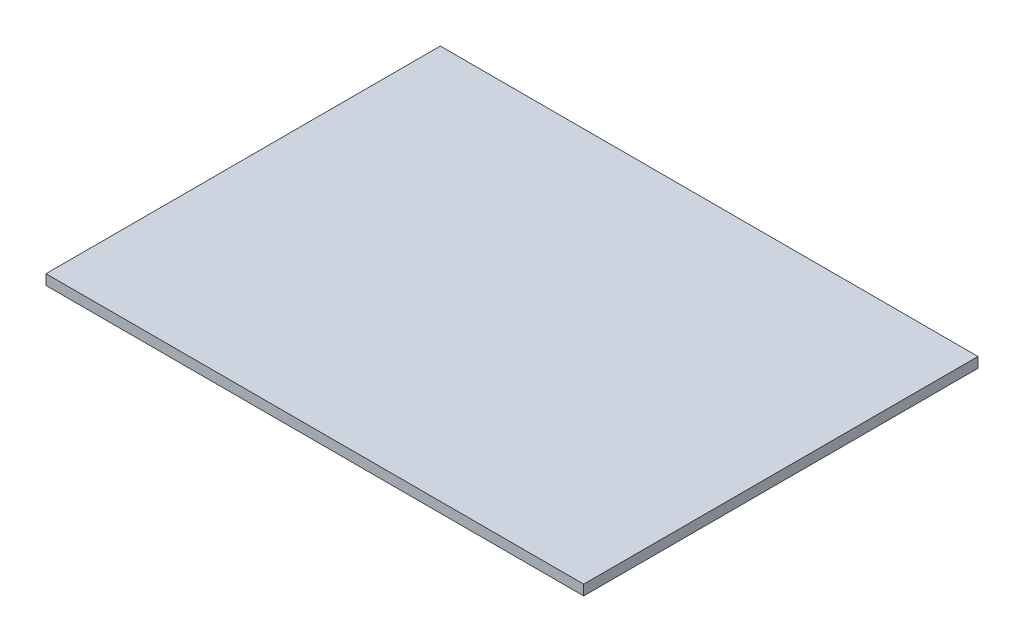
ISO-10303-21;
HEADER;
FILE_DESCRIPTION(('STEP AP214'),'2;1');
FILE_NAME('part.step','',(''),(''),'','','');
FILE_SCHEMA(('AUTOMOTIVE_DESIGN { 1 0 10303 214 1 1 1 1 }'));
ENDSEC;
DATA;
#1=APPLICATION_CONTEXT('core data for automotive mechanical design processes');
#2=APPLICATION_PROTOCOL_DEFINITION('international standard','automotive_design',2000,#1);
#3=PRODUCT_CONTEXT('',#1,'mechanical');
#4=PRODUCT('Part','Part','',(#3));
#5=PRODUCT_RELATED_PRODUCT_CATEGORY('part','',(#4));
#6=PRODUCT_DEFINITION_FORMATION('','',#4);
#7=PRODUCT_DEFINITION_CONTEXT('part definition',#1,'design');
#8=PRODUCT_DEFINITION('design','',#6,#7);
#9=PRODUCT_DEFINITION_SHAPE('','',#8);
#10=(LENGTH_UNIT() NAMED_UNIT(*) SI_UNIT(.MILLI.,.METRE.));
#11=(NAMED_UNIT(*) PLANE_ANGLE_UNIT() SI_UNIT($,.RADIAN.));
#12=(NAMED_UNIT(*) SI_UNIT($,.STERADIAN.) SOLID_ANGLE_UNIT());
#13=UNCERTAINTY_MEASURE_WITH_UNIT(LENGTH_MEASURE(1.E-05),#10,'distance_accuracy_value','');
#14=(GEOMETRIC_REPRESENTATION_CONTEXT(3) GLOBAL_UNCERTAINTY_ASSIGNED_CONTEXT((#13)) GLOBAL_UNIT_ASSIGNED_CONTEXT((#10,
#11,#12)) REPRESENTATION_CONTEXT('',''));
#15=CARTESIAN_POINT('',(0.,0.,0.));
#16=DIRECTION('',(0.,0.,1.));
#17=DIRECTION('',(1.,0.,0.));
#18=AXIS2_PLACEMENT_3D('',#15,#16,#17);
#19=CARTESIAN_POINT('',(52.5,2.,38.5));
#20=DIRECTION('',(-1.,0.,0.));
#21=DIRECTION('',(0.,0.,1.));
#22=AXIS2_PLACEMENT_3D('',#19,#20,#21);
#23=PLANE('',#22);
#24=DIRECTION('',(0.,0.,-1.));
#25=VECTOR('',#24,1.);
#26=CARTESIAN_POINT('',(52.5,0.,38.5));
#27=LINE('',#26,#25);
#28=CARTESIAN_POINT('',(52.5,0.,38.5));
#29=VERTEX_POINT('',#28);
#30=CARTESIAN_POINT('',(52.5,0.,-38.5));
#31=VERTEX_POINT('',#30);
#32=EDGE_CURVE('E100',#29,#31,#27,.T.);
#33=ORIENTED_EDGE('',*,*,#32,.T.);
#34=DIRECTION('',(0.,-1.,0.));
#35=VECTOR('',#34,1.);
#36=CARTESIAN_POINT('',(52.5,2.,-38.5));
#37=LINE('',#36,#35);
#38=CARTESIAN_POINT('',(52.5,2.,-38.5));
#39=VERTEX_POINT('',#38);
#40=EDGE_CURVE('E11',#39,#31,#37,.T.);
#41=ORIENTED_EDGE('',*,*,#40,.F.);
#42=DIRECTION('',(0.,0.,-1.));
#43=VECTOR('',#42,1.);
#44=CARTESIAN_POINT('',(52.5,2.,38.5));
#45=LINE('',#44,#43);
#46=CARTESIAN_POINT('',(52.5,2.,38.5));
#47=VERTEX_POINT('',#46);
#48=EDGE_CURVE('E88',#47,#39,#45,.T.);
#49=ORIENTED_EDGE('',*,*,#48,.F.);
#50=DIRECTION('',(0.,-1.,0.));
#51=VECTOR('',#50,1.);
#52=CARTESIAN_POINT('',(52.5,2.,38.5));
#53=LINE('',#52,#51);
#54=EDGE_CURVE('E96',#47,#29,#53,.T.);
#55=ORIENTED_EDGE('',*,*,#54,.T.);
#56=EDGE_LOOP('',(#33,#41,#49,#55));
#57=FACE_BOUND('',#56,.T.);
#58=ADVANCED_FACE('F37',(#57),#23,.F.);
#59=CARTESIAN_POINT('',(-52.5,2.,-38.5));
#60=DIRECTION('',(0.,0.,1.));
#61=DIRECTION('',(1.,0.,0.));
#62=AXIS2_PLACEMENT_3D('',#59,#60,#61);
#63=PLANE('',#62);
#64=DIRECTION('',(-1.,0.,0.));
#65=VECTOR('',#64,1.);
#66=CARTESIAN_POINT('',(-52.5,0.,-38.5));
#67=LINE('',#66,#65);
#68=CARTESIAN_POINT('',(-52.5,0.,-38.5));
#69=VERTEX_POINT('',#68);
#70=EDGE_CURVE('E92',#31,#69,#67,.T.);
#71=ORIENTED_EDGE('',*,*,#70,.T.);
#72=DIRECTION('',(0.,-1.,0.));
#73=VECTOR('',#72,1.);
#74=CARTESIAN_POINT('',(-52.5,2.,-38.5));
#75=LINE('',#74,#73);
#76=CARTESIAN_POINT('',(-52.5,2.,-38.5));
#77=VERTEX_POINT('',#76);
#78=EDGE_CURVE('E45',#77,#69,#75,.T.);
#79=ORIENTED_EDGE('',*,*,#78,.F.);
#80=DIRECTION('',(-1.,0.,0.));
#81=VECTOR('',#80,1.);
#82=CARTESIAN_POINT('',(-52.5,2.,-38.5));
#83=LINE('',#82,#81);
#84=EDGE_CURVE('E83',#39,#77,#83,.T.);
#85=ORIENTED_EDGE('',*,*,#84,.F.);
#86=ORIENTED_EDGE('',*,*,#40,.T.);
#87=EDGE_LOOP('',(#71,#79,#85,#86));
#88=FACE_BOUND('',#87,.T.);
#89=ADVANCED_FACE('F91',(#88),#63,.F.);
#90=CARTESIAN_POINT('',(-52.5,2.,38.5));
#91=DIRECTION('',(1.,0.,0.));
#92=DIRECTION('',(0.,0.,-1.));
#93=AXIS2_PLACEMENT_3D('',#90,#91,#92);
#94=PLANE('',#93);
#95=DIRECTION('',(0.,0.,1.));
#96=VECTOR('',#95,1.);
#97=CARTESIAN_POINT('',(-52.5,0.,38.5));
#98=LINE('',#97,#96);
#99=CARTESIAN_POINT('',(-52.5,0.,38.5));
#100=VERTEX_POINT('',#99);
#101=EDGE_CURVE('E70',#69,#100,#98,.T.);
#102=ORIENTED_EDGE('',*,*,#101,.T.);
#103=DIRECTION('',(0.,-1.,0.));
#104=VECTOR('',#103,1.);
#105=CARTESIAN_POINT('',(-52.5,2.,38.5));
#106=LINE('',#105,#104);
#107=CARTESIAN_POINT('',(-52.5,2.,38.5));
#108=VERTEX_POINT('',#107);
#109=EDGE_CURVE('E93',#108,#100,#106,.T.);
#110=ORIENTED_EDGE('',*,*,#109,.F.);
#111=DIRECTION('',(0.,0.,1.));
#112=VECTOR('',#111,1.);
#113=CARTESIAN_POINT('',(-52.5,2.,38.5));
#114=LINE('',#113,#112);
#115=EDGE_CURVE('E86',#77,#108,#114,.T.);
#116=ORIENTED_EDGE('',*,*,#115,.F.);
#117=ORIENTED_EDGE('',*,*,#78,.T.);
#118=EDGE_LOOP('',(#102,#110,#116,#117));
#119=FACE_BOUND('',#118,.T.);
#120=ADVANCED_FACE('F94',(#119),#94,.F.);
#121=CARTESIAN_POINT('',(-52.5,2.,38.5));
#122=DIRECTION('',(0.,0.,-1.));
#123=DIRECTION('',(-1.,0.,0.));
#124=AXIS2_PLACEMENT_3D('',#121,#122,#123);
#125=PLANE('',#124);
#126=DIRECTION('',(1.,0.,0.));
#127=VECTOR('',#126,1.);
#128=CARTESIAN_POINT('',(-52.5,0.,38.5));
#129=LINE('',#128,#127);
#130=EDGE_CURVE('E76',#100,#29,#129,.T.);
#131=ORIENTED_EDGE('',*,*,#130,.T.);
#132=ORIENTED_EDGE('',*,*,#54,.F.);
#133=DIRECTION('',(1.,0.,0.));
#134=VECTOR('',#133,1.);
#135=CARTESIAN_POINT('',(-52.5,2.,38.5));
#136=LINE('',#135,#134);
#137=EDGE_CURVE('E53',#108,#47,#136,.T.);
#138=ORIENTED_EDGE('',*,*,#137,.F.);
#139=ORIENTED_EDGE('',*,*,#109,.T.);
#140=EDGE_LOOP('',(#131,#132,#138,#139));
#141=FACE_BOUND('',#140,.T.);
#142=ADVANCED_FACE('F107',(#141),#125,.F.);
#143=CARTESIAN_POINT('',(0.,2.,0.));
#144=DIRECTION('',(0.,-1.,0.));
#145=DIRECTION('',(0.,0.,-1.));
#146=AXIS2_PLACEMENT_3D('',#143,#144,#145);
#147=PLANE('',#146);
#148=ORIENTED_EDGE('',*,*,#48,.T.);
#149=ORIENTED_EDGE('',*,*,#84,.T.);
#150=ORIENTED_EDGE('',*,*,#115,.T.);
#151=ORIENTED_EDGE('',*,*,#137,.T.);
#152=EDGE_LOOP('',(#148,#149,#150,#151));
#153=FACE_BOUND('',#152,.T.);
#154=ADVANCED_FACE('F84',(#153),#147,.F.);
#155=CARTESIAN_POINT('',(0.,0.,0.));
#156=DIRECTION('',(0.,-1.,0.));
#157=DIRECTION('',(0.,0.,-1.));
#158=AXIS2_PLACEMENT_3D('',#155,#156,#157);
#159=PLANE('',#158);
#160=ORIENTED_EDGE('',*,*,#32,.F.);
#161=ORIENTED_EDGE('',*,*,#130,.F.);
#162=ORIENTED_EDGE('',*,*,#101,.F.);
#163=ORIENTED_EDGE('',*,*,#70,.F.);
#164=EDGE_LOOP('',(#160,#161,#162,#163));
#165=FACE_BOUND('',#164,.T.);
#166=ADVANCED_FACE('F110',(#165),#159,.T.);
#167=CLOSED_SHELL('',(#58,#89,#120,#142,#154,#166));
#168=MANIFOLD_SOLID_BREP('B2',#167);
#169=ADVANCED_BREP_SHAPE_REPRESENTATION('',(#18,#168),#14);
#170=SHAPE_DEFINITION_REPRESENTATION(#9,#169);
ENDSEC;
END-ISO-10303-21;
